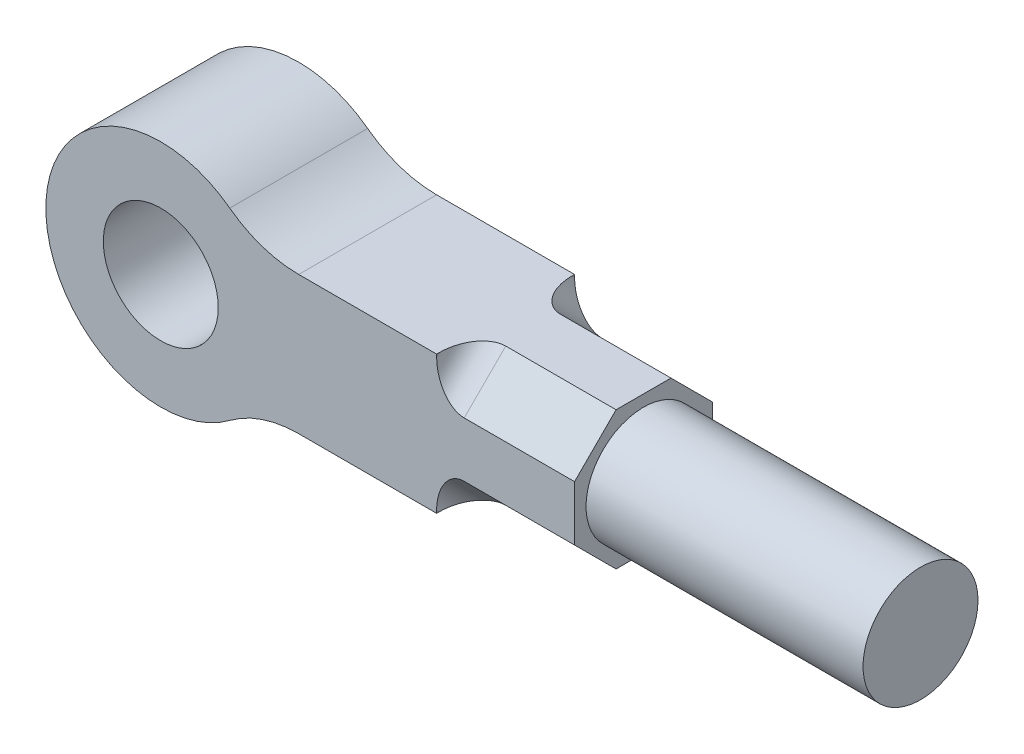
ISO-10303-21;
HEADER;
FILE_DESCRIPTION(('STEP AP214'),'2;1');
FILE_NAME('part.step','',(''),(''),'','','');
FILE_SCHEMA(('AUTOMOTIVE_DESIGN { 1 0 10303 214 1 1 1 1 }'));
ENDSEC;
DATA;
#1=APPLICATION_CONTEXT('core data for automotive mechanical design processes');
#2=APPLICATION_PROTOCOL_DEFINITION('international standard','automotive_design',2000,#1);
#3=PRODUCT_CONTEXT('',#1,'mechanical');
#4=PRODUCT('Part','Part','',(#3));
#5=PRODUCT_RELATED_PRODUCT_CATEGORY('part','',(#4));
#6=PRODUCT_DEFINITION_FORMATION('','',#4);
#7=PRODUCT_DEFINITION_CONTEXT('part definition',#1,'design');
#8=PRODUCT_DEFINITION('design','',#6,#7);
#9=PRODUCT_DEFINITION_SHAPE('','',#8);
#10=(LENGTH_UNIT() NAMED_UNIT(*) SI_UNIT(.MILLI.,.METRE.));
#11=(NAMED_UNIT(*) PLANE_ANGLE_UNIT() SI_UNIT($,.RADIAN.));
#12=(NAMED_UNIT(*) SI_UNIT($,.STERADIAN.) SOLID_ANGLE_UNIT());
#13=UNCERTAINTY_MEASURE_WITH_UNIT(LENGTH_MEASURE(1.E-05),#10,'distance_accuracy_value','');
#14=(GEOMETRIC_REPRESENTATION_CONTEXT(3) GLOBAL_UNCERTAINTY_ASSIGNED_CONTEXT((#13)) GLOBAL_UNIT_ASSIGNED_CONTEXT((#10,
#11,#12)) REPRESENTATION_CONTEXT('',''));
#15=CARTESIAN_POINT('',(0.,0.,0.));
#16=DIRECTION('',(0.,0.,1.));
#17=DIRECTION('',(1.,0.,0.));
#18=AXIS2_PLACEMENT_3D('',#15,#16,#17);
#19=CARTESIAN_POINT('',(600.,-800.,600.));
#20=DIRECTION('',(0.,0.,-1.));
#21=DIRECTION('',(-1.,0.,0.));
#22=AXIS2_PLACEMENT_3D('',#19,#20,#21);
#23=CYLINDRICAL_SURFACE('',#22,500.);
#24=CARTESIAN_POINT('',(600.,-800.,0.));
#25=DIRECTION('',(0.,0.,1.));
#26=DIRECTION('',(1.,0.,0.));
#27=AXIS2_PLACEMENT_3D('',#24,#25,#26);
#28=CIRCLE('',#27,500.);
#29=CARTESIAN_POINT('',(600.,-300.,0.));
#30=VERTEX_POINT('',#29);
#31=CARTESIAN_POINT('',(300.,-400.,0.));
#32=VERTEX_POINT('',#31);
#33=EDGE_CURVE('E307',#30,#32,#28,.T.);
#34=ORIENTED_EDGE('',*,*,#33,.F.);
#35=DIRECTION('',(0.,0.,-1.));
#36=VECTOR('',#35,1.);
#37=CARTESIAN_POINT('',(600.,-300.,600.));
#38=LINE('',#37,#36);
#39=CARTESIAN_POINT('',(600.,-300.,600.));
#40=VERTEX_POINT('',#39);
#41=EDGE_CURVE('E227',#40,#30,#38,.T.);
#42=ORIENTED_EDGE('',*,*,#41,.F.);
#43=CARTESIAN_POINT('',(600.,-800.,600.));
#44=DIRECTION('',(0.,0.,1.));
#45=DIRECTION('',(1.,0.,0.));
#46=AXIS2_PLACEMENT_3D('',#43,#44,#45);
#47=CIRCLE('',#46,500.);
#48=CARTESIAN_POINT('',(300.,-400.,600.));
#49=VERTEX_POINT('',#48);
#50=EDGE_CURVE('E207',#40,#49,#47,.T.);
#51=ORIENTED_EDGE('',*,*,#50,.T.);
#52=DIRECTION('',(0.,0.,-1.));
#53=VECTOR('',#52,1.);
#54=CARTESIAN_POINT('',(300.,-400.,600.));
#55=LINE('',#54,#53);
#56=EDGE_CURVE('E208',#49,#32,#55,.T.);
#57=ORIENTED_EDGE('',*,*,#56,.T.);
#58=EDGE_LOOP('',(#34,#42,#51,#57));
#59=FACE_BOUND('',#58,.T.);
#60=ADVANCED_FACE('F41',(#59),#23,.F.);
#61=CARTESIAN_POINT('',(0.,-300.,600.));
#62=DIRECTION('',(0.,1.,0.));
#63=DIRECTION('',(0.,0.,1.));
#64=AXIS2_PLACEMENT_3D('',#61,#62,#63);
#65=PLANE('',#64);
#66=DIRECTION('',(0.,0.,-1.));
#67=VECTOR('',#66,1.);
#68=CARTESIAN_POINT('',(1800.,-300.,600.));
#69=LINE('',#68,#67);
#70=CARTESIAN_POINT('',(1800.,-300.,419.399999999994));
#71=VERTEX_POINT('',#70);
#72=CARTESIAN_POINT('',(1800.,-300.,180.599999999995));
#73=VERTEX_POINT('',#72);
#74=EDGE_CURVE('E223',#71,#73,#69,.T.);
#75=ORIENTED_EDGE('',*,*,#74,.F.);
#76=DIRECTION('',(1.,0.,0.));
#77=VECTOR('',#76,1.);
#78=CARTESIAN_POINT('',(1200.,-300.,419.399999999994));
#79=LINE('',#78,#77);
#80=CARTESIAN_POINT('',(1320.,-300.,419.399999999994));
#81=VERTEX_POINT('',#80);
#82=EDGE_CURVE('E356',#81,#71,#79,.T.);
#83=ORIENTED_EDGE('',*,*,#82,.F.);
#84=CARTESIAN_POINT('',(1320.,-300.,589.105627484767));
#85=DIRECTION('',(0.,1.,0.));
#86=DIRECTION('',(0.,0.,1.));
#87=AXIS2_PLACEMENT_3D('',#84,#85,#86);
#88=ELLIPSE('',#87,169.70562748477,120.);
#89=CARTESIAN_POINT('',(1200.,-300.,589.105627484767));
#90=VERTEX_POINT('',#89);
#91=EDGE_CURVE('E259',#81,#90,#88,.T.);
#92=ORIENTED_EDGE('',*,*,#91,.T.);
#93=DIRECTION('',(0.,0.,-1.));
#94=VECTOR('',#93,1.);
#95=CARTESIAN_POINT('',(1200.,-300.,0.));
#96=LINE('',#95,#94);
#97=CARTESIAN_POINT('',(1200.,-300.,600.));
#98=VERTEX_POINT('',#97);
#99=EDGE_CURVE('E382',#98,#90,#96,.T.);
#100=ORIENTED_EDGE('',*,*,#99,.F.);
#101=DIRECTION('',(1.,0.,0.));
#102=VECTOR('',#101,1.);
#103=CARTESIAN_POINT('',(0.,-300.,600.));
#104=LINE('',#103,#102);
#105=EDGE_CURVE('E294',#40,#98,#104,.T.);
#106=ORIENTED_EDGE('',*,*,#105,.F.);
#107=ORIENTED_EDGE('',*,*,#41,.T.);
#108=DIRECTION('',(1.,0.,0.));
#109=VECTOR('',#108,1.);
#110=CARTESIAN_POINT('',(0.,-300.,0.));
#111=LINE('',#110,#109);
#112=CARTESIAN_POINT('',(1200.,-300.,0.));
#113=VERTEX_POINT('',#112);
#114=EDGE_CURVE('E196',#30,#113,#111,.T.);
#115=ORIENTED_EDGE('',*,*,#114,.T.);
#116=DIRECTION('',(0.,0.,-1.));
#117=VECTOR('',#116,1.);
#118=CARTESIAN_POINT('',(1200.,-300.,0.));
#119=LINE('',#118,#117);
#120=CARTESIAN_POINT('',(1200.,-300.,10.894372515225));
#121=VERTEX_POINT('',#120);
#122=EDGE_CURVE('E318',#121,#113,#119,.T.);
#123=ORIENTED_EDGE('',*,*,#122,.F.);
#124=CARTESIAN_POINT('',(1320.,-300.,10.894372515225));
#125=DIRECTION('',(0.,1.,0.));
#126=DIRECTION('',(0.,0.,1.));
#127=AXIS2_PLACEMENT_3D('',#124,#125,#126);
#128=ELLIPSE('',#127,169.705627484772,120.);
#129=CARTESIAN_POINT('',(1320.,-300.,180.599999999995));
#130=VERTEX_POINT('',#129);
#131=EDGE_CURVE('E268',#121,#130,#128,.T.);
#132=ORIENTED_EDGE('',*,*,#131,.T.);
#133=DIRECTION('',(1.,0.,0.));
#134=VECTOR('',#133,1.);
#135=CARTESIAN_POINT('',(1200.,-300.,180.599999999995));
#136=LINE('',#135,#134);
#137=EDGE_CURVE('E398',#130,#73,#136,.T.);
#138=ORIENTED_EDGE('',*,*,#137,.T.);
#139=EDGE_LOOP('',(#75,#83,#92,#100,#106,#107,#115,#123,#132,#138));
#140=FACE_BOUND('',#139,.T.);
#141=ADVANCED_FACE('F317',(#140),#65,.F.);
#142=CARTESIAN_POINT('',(1800.,0.,600.));
#143=DIRECTION('',(1.,0.,0.));
#144=DIRECTION('',(0.,0.,-1.));
#145=AXIS2_PLACEMENT_3D('',#142,#143,#144);
#146=PLANE('',#145);
#147=CARTESIAN_POINT('',(1800.,0.,300.));
#148=DIRECTION('',(1.,0.,0.));
#149=DIRECTION('',(0.,0.,-1.));
#150=AXIS2_PLACEMENT_3D('',#147,#148,#149);
#151=CIRCLE('',#150,250.);
#152=CARTESIAN_POINT('',(1800.,0.,50.));
#153=VERTEX_POINT('',#152);
#154=EDGE_CURVE('E230',#153,#153,#151,.T.);
#155=ORIENTED_EDGE('',*,*,#154,.F.);
#156=EDGE_LOOP('',(#155));
#157=FACE_BOUND('',#156,.T.);
#158=DIRECTION('',(0.,0.707106781186552,0.707106781186543));
#159=VECTOR('',#158,1.);
#160=CARTESIAN_POINT('',(1800.,-359.699999999996,359.700000000001));
#161=LINE('',#160,#159);
#162=CARTESIAN_POINT('',(1800.,-119.400000000001,600.));
#163=VERTEX_POINT('',#162);
#164=EDGE_CURVE('E378',#71,#163,#161,.T.);
#165=ORIENTED_EDGE('',*,*,#164,.F.);
#166=ORIENTED_EDGE('',*,*,#74,.T.);
#167=DIRECTION('',(0.,-0.707106781186545,0.70710678118655));
#168=VECTOR('',#167,1.);
#169=CARTESIAN_POINT('',(1800.,-59.7000000000025,-59.7000000000021));
#170=LINE('',#169,#168);
#171=CARTESIAN_POINT('',(1800.,-119.399999999999,0.));
#172=VERTEX_POINT('',#171);
#173=EDGE_CURVE('E377',#172,#73,#170,.T.);
#174=ORIENTED_EDGE('',*,*,#173,.F.);
#175=DIRECTION('',(0.,-1.,0.));
#176=VECTOR('',#175,1.);
#177=CARTESIAN_POINT('',(1800.,0.,0.));
#178=LINE('',#177,#176);
#179=CARTESIAN_POINT('',(1800.,119.4,0.));
#180=VERTEX_POINT('',#179);
#181=EDGE_CURVE('E190',#180,#172,#178,.T.);
#182=ORIENTED_EDGE('',*,*,#181,.F.);
#183=DIRECTION('',(0.,-0.707106781186548,-0.707106781186548));
#184=VECTOR('',#183,1.);
#185=CARTESIAN_POINT('',(1800.,59.7,-59.7));
#186=LINE('',#185,#184);
#187=CARTESIAN_POINT('',(1800.,300.,180.6));
#188=VERTEX_POINT('',#187);
#189=EDGE_CURVE('E181',#188,#180,#186,.T.);
#190=ORIENTED_EDGE('',*,*,#189,.F.);
#191=DIRECTION('',(0.,0.,-1.));
#192=VECTOR('',#191,1.);
#193=CARTESIAN_POINT('',(1800.,300.,600.));
#194=LINE('',#193,#192);
#195=CARTESIAN_POINT('',(1800.,300.,419.399999999994));
#196=VERTEX_POINT('',#195);
#197=EDGE_CURVE('E219',#196,#188,#194,.T.);
#198=ORIENTED_EDGE('',*,*,#197,.F.);
#199=DIRECTION('',(0.,0.70710678118654,-0.707106781186555));
#200=VECTOR('',#199,1.);
#201=CARTESIAN_POINT('',(1800.,359.699999999998,359.69999999999));
#202=LINE('',#201,#200);
#203=CARTESIAN_POINT('',(1800.,119.399999999997,600.));
#204=VERTEX_POINT('',#203);
#205=EDGE_CURVE('E347',#204,#196,#202,.T.);
#206=ORIENTED_EDGE('',*,*,#205,.F.);
#207=DIRECTION('',(0.,-1.,0.));
#208=VECTOR('',#207,1.);
#209=CARTESIAN_POINT('',(1800.,0.,600.));
#210=LINE('',#209,#208);
#211=EDGE_CURVE('E290',#204,#163,#210,.T.);
#212=ORIENTED_EDGE('',*,*,#211,.T.);
#213=EDGE_LOOP('',(#165,#166,#174,#182,#190,#198,#206,#212));
#214=FACE_BOUND('',#213,.T.);
#215=ADVANCED_FACE('F369',(#157,#214),#146,.T.);
#216=CARTESIAN_POINT('',(0.,300.,600.));
#217=DIRECTION('',(0.,1.,0.));
#218=DIRECTION('',(0.,0.,1.));
#219=AXIS2_PLACEMENT_3D('',#216,#217,#218);
#220=PLANE('',#219);
#221=DIRECTION('',(1.,0.,0.));
#222=VECTOR('',#221,1.);
#223=CARTESIAN_POINT('',(1200.,300.,180.6));
#224=LINE('',#223,#222);
#225=CARTESIAN_POINT('',(1320.,300.,180.6));
#226=VERTEX_POINT('',#225);
#227=EDGE_CURVE('E173',#226,#188,#224,.T.);
#228=ORIENTED_EDGE('',*,*,#227,.F.);
#229=CARTESIAN_POINT('',(1320.,300.,10.8943725152286));
#230=DIRECTION('',(0.,1.,0.));
#231=DIRECTION('',(0.,0.,-1.));
#232=AXIS2_PLACEMENT_3D('',#229,#230,#231);
#233=ELLIPSE('',#232,169.705627484771,120.);
#234=CARTESIAN_POINT('',(1200.,300.,10.8943725152286));
#235=VERTEX_POINT('',#234);
#236=EDGE_CURVE('E11',#226,#235,#233,.F.);
#237=ORIENTED_EDGE('',*,*,#236,.T.);
#238=DIRECTION('',(0.,0.,1.));
#239=VECTOR('',#238,1.);
#240=CARTESIAN_POINT('',(1200.,300.,0.));
#241=LINE('',#240,#239);
#242=CARTESIAN_POINT('',(1200.,300.,0.));
#243=VERTEX_POINT('',#242);
#244=EDGE_CURVE('E168',#243,#235,#241,.T.);
#245=ORIENTED_EDGE('',*,*,#244,.F.);
#246=DIRECTION('',(1.,0.,0.));
#247=VECTOR('',#246,1.);
#248=CARTESIAN_POINT('',(0.,300.,0.));
#249=LINE('',#248,#247);
#250=CARTESIAN_POINT('',(600.,300.,0.));
#251=VERTEX_POINT('',#250);
#252=EDGE_CURVE('E178',#251,#243,#249,.T.);
#253=ORIENTED_EDGE('',*,*,#252,.F.);
#254=DIRECTION('',(0.,0.,-1.));
#255=VECTOR('',#254,1.);
#256=CARTESIAN_POINT('',(600.,300.,600.));
#257=LINE('',#256,#255);
#258=CARTESIAN_POINT('',(600.,300.,600.));
#259=VERTEX_POINT('',#258);
#260=EDGE_CURVE('E216',#259,#251,#257,.T.);
#261=ORIENTED_EDGE('',*,*,#260,.F.);
#262=DIRECTION('',(1.,0.,0.));
#263=VECTOR('',#262,1.);
#264=CARTESIAN_POINT('',(0.,300.,600.));
#265=LINE('',#264,#263);
#266=CARTESIAN_POINT('',(1200.,300.,600.));
#267=VERTEX_POINT('',#266);
#268=EDGE_CURVE('E286',#259,#267,#265,.T.);
#269=ORIENTED_EDGE('',*,*,#268,.T.);
#270=DIRECTION('',(0.,0.,1.));
#271=VECTOR('',#270,1.);
#272=CARTESIAN_POINT('',(1200.,300.,0.));
#273=LINE('',#272,#271);
#274=CARTESIAN_POINT('',(1200.,300.,589.105627484762));
#275=VERTEX_POINT('',#274);
#276=EDGE_CURVE('E334',#275,#267,#273,.T.);
#277=ORIENTED_EDGE('',*,*,#276,.F.);
#278=CARTESIAN_POINT('',(1320.,300.,589.105627484763));
#279=DIRECTION('',(0.,1.,0.));
#280=DIRECTION('',(0.,0.,-1.));
#281=AXIS2_PLACEMENT_3D('',#278,#279,#280);
#282=ELLIPSE('',#281,169.705627484773,120.);
#283=CARTESIAN_POINT('',(1320.,300.,419.399999999994));
#284=VERTEX_POINT('',#283);
#285=EDGE_CURVE('E262',#275,#284,#282,.F.);
#286=ORIENTED_EDGE('',*,*,#285,.T.);
#287=DIRECTION('',(1.,0.,0.));
#288=VECTOR('',#287,1.);
#289=CARTESIAN_POINT('',(1200.,300.,419.399999999994));
#290=LINE('',#289,#288);
#291=EDGE_CURVE('E310',#284,#196,#290,.T.);
#292=ORIENTED_EDGE('',*,*,#291,.T.);
#293=ORIENTED_EDGE('',*,*,#197,.T.);
#294=EDGE_LOOP('',(#228,#237,#245,#253,#261,#269,#277,#286,#292,#293));
#295=FACE_BOUND('',#294,.T.);
#296=ADVANCED_FACE('F177',(#295),#220,.T.);
#297=CARTESIAN_POINT('',(600.,800.,600.));
#298=DIRECTION('',(0.,0.,-1.));
#299=DIRECTION('',(-1.,0.,0.));
#300=AXIS2_PLACEMENT_3D('',#297,#298,#299);
#301=CYLINDRICAL_SURFACE('',#300,500.);
#302=CARTESIAN_POINT('',(600.,800.,0.));
#303=DIRECTION('',(0.,0.,1.));
#304=DIRECTION('',(1.,0.,0.));
#305=AXIS2_PLACEMENT_3D('',#302,#303,#304);
#306=CIRCLE('',#305,500.);
#307=CARTESIAN_POINT('',(300.,400.,0.));
#308=VERTEX_POINT('',#307);
#309=EDGE_CURVE('E188',#251,#308,#306,.F.);
#310=ORIENTED_EDGE('',*,*,#309,.T.);
#311=DIRECTION('',(0.,0.,-1.));
#312=VECTOR('',#311,1.);
#313=CARTESIAN_POINT('',(300.,400.,600.));
#314=LINE('',#313,#312);
#315=CARTESIAN_POINT('',(300.,400.,600.));
#316=VERTEX_POINT('',#315);
#317=EDGE_CURVE('E211',#316,#308,#314,.T.);
#318=ORIENTED_EDGE('',*,*,#317,.F.);
#319=CARTESIAN_POINT('',(600.,800.,600.));
#320=DIRECTION('',(0.,0.,1.));
#321=DIRECTION('',(1.,0.,0.));
#322=AXIS2_PLACEMENT_3D('',#319,#320,#321);
#323=CIRCLE('',#322,500.);
#324=EDGE_CURVE('E283',#259,#316,#323,.F.);
#325=ORIENTED_EDGE('',*,*,#324,.F.);
#326=ORIENTED_EDGE('',*,*,#260,.T.);
#327=EDGE_LOOP('',(#310,#318,#325,#326));
#328=FACE_BOUND('',#327,.T.);
#329=ADVANCED_FACE('F331',(#328),#301,.F.);
#330=CARTESIAN_POINT('',(0.,0.,600.));
#331=DIRECTION('',(0.,0.,-1.));
#332=DIRECTION('',(-1.,0.,0.));
#333=AXIS2_PLACEMENT_3D('',#330,#331,#332);
#334=CYLINDRICAL_SURFACE('',#333,500.);
#335=CARTESIAN_POINT('',(0.,0.,0.));
#336=DIRECTION('',(0.,0.,1.));
#337=DIRECTION('',(1.,0.,0.));
#338=AXIS2_PLACEMENT_3D('',#335,#336,#337);
#339=CIRCLE('',#338,500.);
#340=EDGE_CURVE('E194',#308,#32,#339,.T.);
#341=ORIENTED_EDGE('',*,*,#340,.T.);
#342=ORIENTED_EDGE('',*,*,#56,.F.);
#343=CARTESIAN_POINT('',(0.,0.,600.));
#344=DIRECTION('',(0.,0.,1.));
#345=DIRECTION('',(1.,0.,0.));
#346=AXIS2_PLACEMENT_3D('',#343,#344,#345);
#347=CIRCLE('',#346,500.);
#348=EDGE_CURVE('E280',#316,#49,#347,.T.);
#349=ORIENTED_EDGE('',*,*,#348,.F.);
#350=ORIENTED_EDGE('',*,*,#317,.T.);
#351=EDGE_LOOP('',(#341,#342,#349,#350));
#352=FACE_BOUND('',#351,.T.);
#353=ADVANCED_FACE('F327',(#352),#334,.T.);
#354=CARTESIAN_POINT('',(0.,0.,600.));
#355=DIRECTION('',(0.,0.,-1.));
#356=DIRECTION('',(-1.,0.,0.));
#357=AXIS2_PLACEMENT_3D('',#354,#355,#356);
#358=CYLINDRICAL_SURFACE('',#357,250.);
#359=CARTESIAN_POINT('',(0.,0.,600.));
#360=DIRECTION('',(0.,0.,1.));
#361=DIRECTION('',(1.,0.,0.));
#362=AXIS2_PLACEMENT_3D('',#359,#360,#361);
#363=CIRCLE('',#362,250.);
#364=CARTESIAN_POINT('',(250.,0.,600.));
#365=VERTEX_POINT('',#364);
#366=EDGE_CURVE('E212',#365,#365,#363,.T.);
#367=ORIENTED_EDGE('',*,*,#366,.T.);
#368=EDGE_LOOP('',(#367));
#369=FACE_BOUND('',#368,.T.);
#370=CARTESIAN_POINT('',(0.,0.,0.));
#371=DIRECTION('',(0.,0.,1.));
#372=DIRECTION('',(1.,0.,0.));
#373=AXIS2_PLACEMENT_3D('',#370,#371,#372);
#374=CIRCLE('',#373,250.);
#375=CARTESIAN_POINT('',(250.,0.,0.));
#376=VERTEX_POINT('',#375);
#377=EDGE_CURVE('E203',#376,#376,#374,.T.);
#378=ORIENTED_EDGE('',*,*,#377,.F.);
#379=EDGE_LOOP('',(#378));
#380=FACE_BOUND('',#379,.T.);
#381=ADVANCED_FACE('F555',(#369,#380),#358,.F.);
#382=CARTESIAN_POINT('',(0.,0.,600.));
#383=DIRECTION('',(0.,0.,1.));
#384=DIRECTION('',(1.,0.,0.));
#385=AXIS2_PLACEMENT_3D('',#382,#383,#384);
#386=PLANE('',#385);
#387=DIRECTION('',(0.,-1.,0.));
#388=VECTOR('',#387,1.);
#389=CARTESIAN_POINT('',(1200.,0.,600.));
#390=LINE('',#389,#388);
#391=CARTESIAN_POINT('',(1200.,-289.105627484766,600.));
#392=VERTEX_POINT('',#391);
#393=EDGE_CURVE('E388',#392,#98,#390,.T.);
#394=ORIENTED_EDGE('',*,*,#393,.F.);
#395=CARTESIAN_POINT('',(1320.,-289.105627484767,600.));
#396=DIRECTION('',(0.,0.,1.));
#397=DIRECTION('',(0.,1.,0.));
#398=AXIS2_PLACEMENT_3D('',#395,#396,#397);
#399=ELLIPSE('',#398,169.705627484773,120.);
#400=CARTESIAN_POINT('',(1320.,-119.400000000001,600.));
#401=VERTEX_POINT('',#400);
#402=EDGE_CURVE('E256',#392,#401,#399,.F.);
#403=ORIENTED_EDGE('',*,*,#402,.T.);
#404=DIRECTION('',(1.,0.,0.));
#405=VECTOR('',#404,1.);
#406=CARTESIAN_POINT('',(1200.,-119.400000000001,600.));
#407=LINE('',#406,#405);
#408=EDGE_CURVE('E372',#401,#163,#407,.T.);
#409=ORIENTED_EDGE('',*,*,#408,.T.);
#410=ORIENTED_EDGE('',*,*,#211,.F.);
#411=DIRECTION('',(1.,0.,0.));
#412=VECTOR('',#411,1.);
#413=CARTESIAN_POINT('',(1200.,119.399999999997,600.));
#414=LINE('',#413,#412);
#415=CARTESIAN_POINT('',(1320.,119.399999999997,600.));
#416=VERTEX_POINT('',#415);
#417=EDGE_CURVE('E304',#416,#204,#414,.T.);
#418=ORIENTED_EDGE('',*,*,#417,.F.);
#419=CARTESIAN_POINT('',(1320.,289.105627484763,600.));
#420=DIRECTION('',(0.,0.,1.));
#421=DIRECTION('',(0.,1.,0.));
#422=AXIS2_PLACEMENT_3D('',#419,#420,#421);
#423=ELLIPSE('',#422,169.70562748477,120.);
#424=CARTESIAN_POINT('',(1200.,289.105627484763,600.));
#425=VERTEX_POINT('',#424);
#426=EDGE_CURVE('E265',#416,#425,#423,.F.);
#427=ORIENTED_EDGE('',*,*,#426,.T.);
#428=DIRECTION('',(0.,-1.,0.));
#429=VECTOR('',#428,1.);
#430=CARTESIAN_POINT('',(1200.,0.,600.));
#431=LINE('',#430,#429);
#432=EDGE_CURVE('E341',#267,#425,#431,.T.);
#433=ORIENTED_EDGE('',*,*,#432,.F.);
#434=ORIENTED_EDGE('',*,*,#268,.F.);
#435=ORIENTED_EDGE('',*,*,#324,.T.);
#436=ORIENTED_EDGE('',*,*,#348,.T.);
#437=ORIENTED_EDGE('',*,*,#50,.F.);
#438=ORIENTED_EDGE('',*,*,#105,.T.);
#439=EDGE_LOOP('',(#394,#403,#409,#410,#418,#427,#433,#434,#435,#436,#437,#438));
#440=FACE_BOUND('',#439,.T.);
#441=ORIENTED_EDGE('',*,*,#366,.F.);
#442=EDGE_LOOP('',(#441));
#443=FACE_BOUND('',#442,.T.);
#444=ADVANCED_FACE('F338',(#440,#443),#386,.T.);
#445=CARTESIAN_POINT('',(0.,0.,0.));
#446=DIRECTION('',(0.,0.,1.));
#447=DIRECTION('',(1.,0.,0.));
#448=AXIS2_PLACEMENT_3D('',#445,#446,#447);
#449=PLANE('',#448);
#450=ORIENTED_EDGE('',*,*,#181,.T.);
#451=DIRECTION('',(1.,0.,0.));
#452=VECTOR('',#451,1.);
#453=CARTESIAN_POINT('',(1200.,-119.399999999999,0.));
#454=LINE('',#453,#452);
#455=CARTESIAN_POINT('',(1320.,-119.399999999999,0.));
#456=VERTEX_POINT('',#455);
#457=EDGE_CURVE('E395',#456,#172,#454,.T.);
#458=ORIENTED_EDGE('',*,*,#457,.F.);
#459=CARTESIAN_POINT('',(1320.,-289.105627484775,0.));
#460=DIRECTION('',(0.,0.,1.));
#461=DIRECTION('',(0.,-1.,0.));
#462=AXIS2_PLACEMENT_3D('',#459,#460,#461);
#463=ELLIPSE('',#462,169.705627484771,120.);
#464=CARTESIAN_POINT('',(1200.,-289.105627484775,0.));
#465=VERTEX_POINT('',#464);
#466=EDGE_CURVE('E271',#456,#465,#463,.T.);
#467=ORIENTED_EDGE('',*,*,#466,.T.);
#468=DIRECTION('',(0.,1.,0.));
#469=VECTOR('',#468,1.);
#470=CARTESIAN_POINT('',(1200.,0.,0.));
#471=LINE('',#470,#469);
#472=EDGE_CURVE('E323',#113,#465,#471,.T.);
#473=ORIENTED_EDGE('',*,*,#472,.F.);
#474=ORIENTED_EDGE('',*,*,#114,.F.);
#475=ORIENTED_EDGE('',*,*,#33,.T.);
#476=ORIENTED_EDGE('',*,*,#340,.F.);
#477=ORIENTED_EDGE('',*,*,#309,.F.);
#478=ORIENTED_EDGE('',*,*,#252,.T.);
#479=DIRECTION('',(0.,1.,0.));
#480=VECTOR('',#479,1.);
#481=CARTESIAN_POINT('',(1200.,0.,0.));
#482=LINE('',#481,#480);
#483=CARTESIAN_POINT('',(1200.,289.105627484771,0.));
#484=VERTEX_POINT('',#483);
#485=EDGE_CURVE('E165',#484,#243,#482,.T.);
#486=ORIENTED_EDGE('',*,*,#485,.F.);
#487=CARTESIAN_POINT('',(1320.,289.105627484771,0.));
#488=DIRECTION('',(0.,0.,1.));
#489=DIRECTION('',(0.,-1.,0.));
#490=AXIS2_PLACEMENT_3D('',#487,#488,#489);
#491=ELLIPSE('',#490,169.705627484771,120.);
#492=CARTESIAN_POINT('',(1320.,119.4,0.));
#493=VERTEX_POINT('',#492);
#494=EDGE_CURVE('E50',#484,#493,#491,.T.);
#495=ORIENTED_EDGE('',*,*,#494,.T.);
#496=DIRECTION('',(1.,0.,0.));
#497=VECTOR('',#496,1.);
#498=CARTESIAN_POINT('',(1200.,119.4,0.));
#499=LINE('',#498,#497);
#500=EDGE_CURVE('E353',#493,#180,#499,.T.);
#501=ORIENTED_EDGE('',*,*,#500,.T.);
#502=EDGE_LOOP('',(#450,#458,#467,#473,#474,#475,#476,#477,#478,#486,#495,#501));
#503=FACE_BOUND('',#502,.T.);
#504=ORIENTED_EDGE('',*,*,#377,.T.);
#505=EDGE_LOOP('',(#504));
#506=FACE_BOUND('',#505,.T.);
#507=ADVANCED_FACE('F185',(#503,#506),#449,.F.);
#508=CARTESIAN_POINT('',(1200.,59.7,-59.7));
#509=DIRECTION('',(0.,-0.707106781186548,0.707106781186548));
#510=DIRECTION('',(0.,-0.707106781186548,-0.707106781186548));
#511=AXIS2_PLACEMENT_3D('',#508,#509,#510);
#512=PLANE('',#511);
#513=ORIENTED_EDGE('',*,*,#500,.F.);
#514=DIRECTION('',(0.,-0.707106781186548,-0.707106781186548));
#515=VECTOR('',#514,1.);
#516=CARTESIAN_POINT('',(1320.,59.7,-59.7));
#517=LINE('',#516,#515);
#518=EDGE_CURVE('E57',#493,#226,#517,.F.);
#519=ORIENTED_EDGE('',*,*,#518,.T.);
#520=ORIENTED_EDGE('',*,*,#227,.T.);
#521=ORIENTED_EDGE('',*,*,#189,.T.);
#522=EDGE_LOOP('',(#513,#519,#520,#521));
#523=FACE_BOUND('',#522,.T.);
#524=ADVANCED_FACE('F415',(#523),#512,.F.);
#525=CARTESIAN_POINT('',(1200.,0.,0.));
#526=DIRECTION('',(1.,0.,0.));
#527=DIRECTION('',(0.,0.,-1.));
#528=AXIS2_PLACEMENT_3D('',#525,#526,#527);
#529=PLANE('',#528);
#530=ORIENTED_EDGE('',*,*,#244,.T.);
#531=DIRECTION('',(0.,-0.707106781186548,-0.707106781186548));
#532=VECTOR('',#531,1.);
#533=CARTESIAN_POINT('',(1200.,144.552813742386,-144.552813742386));
#534=LINE('',#533,#532);
#535=EDGE_CURVE('E170',#235,#484,#534,.T.);
#536=ORIENTED_EDGE('',*,*,#535,.T.);
#537=ORIENTED_EDGE('',*,*,#485,.T.);
#538=EDGE_LOOP('',(#530,#536,#537));
#539=FACE_BOUND('',#538,.T.);
#540=ADVANCED_FACE('F167',(#539),#529,.T.);
#541=CARTESIAN_POINT('',(1200.,-59.7000000000025,-59.7000000000021));
#542=DIRECTION('',(0.,0.70710678118655,0.707106781186545));
#543=DIRECTION('',(0.,-0.707106781186545,0.70710678118655));
#544=AXIS2_PLACEMENT_3D('',#541,#542,#543);
#545=PLANE('',#544);
#546=ORIENTED_EDGE('',*,*,#137,.F.);
#547=DIRECTION('',(0.,-0.707106781186545,0.70710678118655));
#548=VECTOR('',#547,1.);
#549=CARTESIAN_POINT('',(1320.,-59.7000000000025,-59.7000000000021));
#550=LINE('',#549,#548);
#551=EDGE_CURVE('E249',#130,#456,#550,.F.);
#552=ORIENTED_EDGE('',*,*,#551,.T.);
#553=ORIENTED_EDGE('',*,*,#457,.T.);
#554=ORIENTED_EDGE('',*,*,#173,.T.);
#555=EDGE_LOOP('',(#546,#552,#553,#554));
#556=FACE_BOUND('',#555,.T.);
#557=ADVANCED_FACE('F427',(#556),#545,.F.);
#558=CARTESIAN_POINT('',(1200.,0.,0.));
#559=DIRECTION('',(1.,0.,0.));
#560=DIRECTION('',(0.,0.,-1.));
#561=AXIS2_PLACEMENT_3D('',#558,#559,#560);
#562=PLANE('',#561);
#563=ORIENTED_EDGE('',*,*,#472,.T.);
#564=DIRECTION('',(0.,-0.707106781186545,0.70710678118655));
#565=VECTOR('',#564,1.);
#566=CARTESIAN_POINT('',(1200.,-144.552813742388,-144.552813742388));
#567=LINE('',#566,#565);
#568=EDGE_CURVE('E245',#465,#121,#567,.T.);
#569=ORIENTED_EDGE('',*,*,#568,.T.);
#570=ORIENTED_EDGE('',*,*,#122,.T.);
#571=EDGE_LOOP('',(#563,#569,#570));
#572=FACE_BOUND('',#571,.T.);
#573=ADVANCED_FACE('F425',(#572),#562,.T.);
#574=CARTESIAN_POINT('',(1200.,359.699999999998,359.69999999999));
#575=DIRECTION('',(0.,-0.707106781186555,-0.70710678118654));
#576=DIRECTION('',(0.,0.70710678118654,-0.707106781186555));
#577=AXIS2_PLACEMENT_3D('',#574,#575,#576);
#578=PLANE('',#577);
#579=ORIENTED_EDGE('',*,*,#291,.F.);
#580=DIRECTION('',(0.,0.70710678118654,-0.707106781186555));
#581=VECTOR('',#580,1.);
#582=CARTESIAN_POINT('',(1320.,359.699999999998,359.69999999999));
#583=LINE('',#582,#581);
#584=EDGE_CURVE('E242',#284,#416,#583,.F.);
#585=ORIENTED_EDGE('',*,*,#584,.T.);
#586=ORIENTED_EDGE('',*,*,#417,.T.);
#587=ORIENTED_EDGE('',*,*,#205,.T.);
#588=EDGE_LOOP('',(#579,#585,#586,#587));
#589=FACE_BOUND('',#588,.T.);
#590=ADVANCED_FACE('F363',(#589),#578,.F.);
#591=CARTESIAN_POINT('',(1200.,0.,0.));
#592=DIRECTION('',(1.,0.,0.));
#593=DIRECTION('',(0.,0.,-1.));
#594=AXIS2_PLACEMENT_3D('',#591,#592,#593);
#595=PLANE('',#594);
#596=ORIENTED_EDGE('',*,*,#432,.T.);
#597=DIRECTION('',(0.,0.70710678118654,-0.707106781186555));
#598=VECTOR('',#597,1.);
#599=CARTESIAN_POINT('',(1200.,444.552813742384,444.552813742375));
#600=LINE('',#599,#598);
#601=EDGE_CURVE('E238',#425,#275,#600,.T.);
#602=ORIENTED_EDGE('',*,*,#601,.T.);
#603=ORIENTED_EDGE('',*,*,#276,.T.);
#604=EDGE_LOOP('',(#596,#602,#603));
#605=FACE_BOUND('',#604,.T.);
#606=ADVANCED_FACE('F433',(#605),#595,.T.);
#607=CARTESIAN_POINT('',(1200.,-359.699999999996,359.700000000001));
#608=DIRECTION('',(0.,0.707106781186543,-0.707106781186552));
#609=DIRECTION('',(0.,0.707106781186552,0.707106781186543));
#610=AXIS2_PLACEMENT_3D('',#607,#608,#609);
#611=PLANE('',#610);
#612=ORIENTED_EDGE('',*,*,#408,.F.);
#613=DIRECTION('',(0.,0.707106781186552,0.707106781186543));
#614=VECTOR('',#613,1.);
#615=CARTESIAN_POINT('',(1320.,-359.699999999996,359.700000000001));
#616=LINE('',#615,#614);
#617=EDGE_CURVE('E235',#401,#81,#616,.F.);
#618=ORIENTED_EDGE('',*,*,#617,.T.);
#619=ORIENTED_EDGE('',*,*,#82,.T.);
#620=ORIENTED_EDGE('',*,*,#164,.T.);
#621=EDGE_LOOP('',(#612,#618,#619,#620));
#622=FACE_BOUND('',#621,.T.);
#623=ADVANCED_FACE('F379',(#622),#611,.F.);
#624=CARTESIAN_POINT('',(1200.,0.,0.));
#625=DIRECTION('',(1.,0.,0.));
#626=DIRECTION('',(0.,0.,-1.));
#627=AXIS2_PLACEMENT_3D('',#624,#625,#626);
#628=PLANE('',#627);
#629=ORIENTED_EDGE('',*,*,#99,.T.);
#630=DIRECTION('',(0.,0.707106781186552,0.707106781186543));
#631=VECTOR('',#630,1.);
#632=CARTESIAN_POINT('',(1200.,-444.552813742381,444.552813742387));
#633=LINE('',#632,#631);
#634=EDGE_CURVE('E231',#90,#392,#633,.T.);
#635=ORIENTED_EDGE('',*,*,#634,.T.);
#636=ORIENTED_EDGE('',*,*,#393,.T.);
#637=EDGE_LOOP('',(#629,#635,#636));
#638=FACE_BOUND('',#637,.T.);
#639=ADVANCED_FACE('F483',(#638),#628,.T.);
#640=CARTESIAN_POINT('',(3005.,0.,300.));
#641=DIRECTION('',(-1.,0.,0.));
#642=DIRECTION('',(0.,0.,1.));
#643=AXIS2_PLACEMENT_3D('',#640,#641,#642);
#644=CYLINDRICAL_SURFACE('',#643,250.);
#645=CARTESIAN_POINT('',(3005.,0.,300.));
#646=DIRECTION('',(1.,0.,0.));
#647=DIRECTION('',(0.,0.,-1.));
#648=AXIS2_PLACEMENT_3D('',#645,#646,#647);
#649=CIRCLE('',#648,250.);
#650=CARTESIAN_POINT('',(3005.,0.,50.));
#651=VERTEX_POINT('',#650);
#652=EDGE_CURVE('E383',#651,#651,#649,.T.);
#653=ORIENTED_EDGE('',*,*,#652,.F.);
#654=EDGE_LOOP('',(#653));
#655=FACE_BOUND('',#654,.T.);
#656=ORIENTED_EDGE('',*,*,#154,.T.);
#657=EDGE_LOOP('',(#656));
#658=FACE_BOUND('',#657,.T.);
#659=ADVANCED_FACE('F488',(#655,#658),#644,.T.);
#660=CARTESIAN_POINT('',(3005.,0.,0.));
#661=DIRECTION('',(1.,0.,0.));
#662=DIRECTION('',(0.,0.,-1.));
#663=AXIS2_PLACEMENT_3D('',#660,#661,#662);
#664=PLANE('',#663);
#665=ORIENTED_EDGE('',*,*,#652,.T.);
#666=EDGE_LOOP('',(#665));
#667=FACE_BOUND('',#666,.T.);
#668=ADVANCED_FACE('F449',(#667),#664,.T.);
#669=CARTESIAN_POINT('',(1320.,-444.552813742381,444.552813742387));
#670=DIRECTION('',(0.,0.707106781186552,0.707106781186543));
#671=DIRECTION('',(0.,-0.707106781186543,0.707106781186552));
#672=AXIS2_PLACEMENT_3D('',#669,#670,#671);
#673=CYLINDRICAL_SURFACE('',#672,120.);
#674=ORIENTED_EDGE('',*,*,#91,.F.);
#675=ORIENTED_EDGE('',*,*,#617,.F.);
#676=ORIENTED_EDGE('',*,*,#402,.F.);
#677=ORIENTED_EDGE('',*,*,#634,.F.);
#678=EDGE_LOOP('',(#674,#675,#676,#677));
#679=FACE_BOUND('',#678,.T.);
#680=ADVANCED_FACE('F445',(#679),#673,.F.);
#681=CARTESIAN_POINT('',(1320.,444.552813742384,444.552813742375));
#682=DIRECTION('',(0.,0.70710678118654,-0.707106781186555));
#683=DIRECTION('',(0.,0.707106781186555,0.70710678118654));
#684=AXIS2_PLACEMENT_3D('',#681,#682,#683);
#685=CYLINDRICAL_SURFACE('',#684,120.);
#686=ORIENTED_EDGE('',*,*,#426,.F.);
#687=ORIENTED_EDGE('',*,*,#584,.F.);
#688=ORIENTED_EDGE('',*,*,#285,.F.);
#689=ORIENTED_EDGE('',*,*,#601,.F.);
#690=EDGE_LOOP('',(#686,#687,#688,#689));
#691=FACE_BOUND('',#690,.T.);
#692=ADVANCED_FACE('F448',(#691),#685,.F.);
#693=CARTESIAN_POINT('',(1320.,-144.552813742388,-144.552813742388));
#694=DIRECTION('',(0.,-0.707106781186545,0.70710678118655));
#695=DIRECTION('',(0.,-0.70710678118655,-0.707106781186545));
#696=AXIS2_PLACEMENT_3D('',#693,#694,#695);
#697=CYLINDRICAL_SURFACE('',#696,120.);
#698=ORIENTED_EDGE('',*,*,#466,.F.);
#699=ORIENTED_EDGE('',*,*,#551,.F.);
#700=ORIENTED_EDGE('',*,*,#131,.F.);
#701=ORIENTED_EDGE('',*,*,#568,.F.);
#702=EDGE_LOOP('',(#698,#699,#700,#701));
#703=FACE_BOUND('',#702,.T.);
#704=ADVANCED_FACE('F423',(#703),#697,.F.);
#705=CARTESIAN_POINT('',(1320.,144.552813742386,-144.552813742386));
#706=DIRECTION('',(0.,-0.707106781186548,-0.707106781186548));
#707=DIRECTION('',(0.,0.707106781186548,-0.707106781186548));
#708=AXIS2_PLACEMENT_3D('',#705,#706,#707);
#709=CYLINDRICAL_SURFACE('',#708,120.);
#710=ORIENTED_EDGE('',*,*,#236,.F.);
#711=ORIENTED_EDGE('',*,*,#518,.F.);
#712=ORIENTED_EDGE('',*,*,#494,.F.);
#713=ORIENTED_EDGE('',*,*,#535,.F.);
#714=EDGE_LOOP('',(#710,#711,#712,#713));
#715=FACE_BOUND('',#714,.T.);
#716=ADVANCED_FACE('F43',(#715),#709,.F.);
#717=CLOSED_SHELL('',(#60,#141,#215,#296,#329,#353,#381,#444,#507,#524,#540,#557,#573,#590,#606,
#623,#639,#659,#668,#680,#692,#704,#716));
#718=MANIFOLD_SOLID_BREP('B2',#717);
#719=ADVANCED_BREP_SHAPE_REPRESENTATION('',(#18,#718),#14);
#720=SHAPE_DEFINITION_REPRESENTATION(#9,#719);
ENDSEC;
END-ISO-10303-21;
